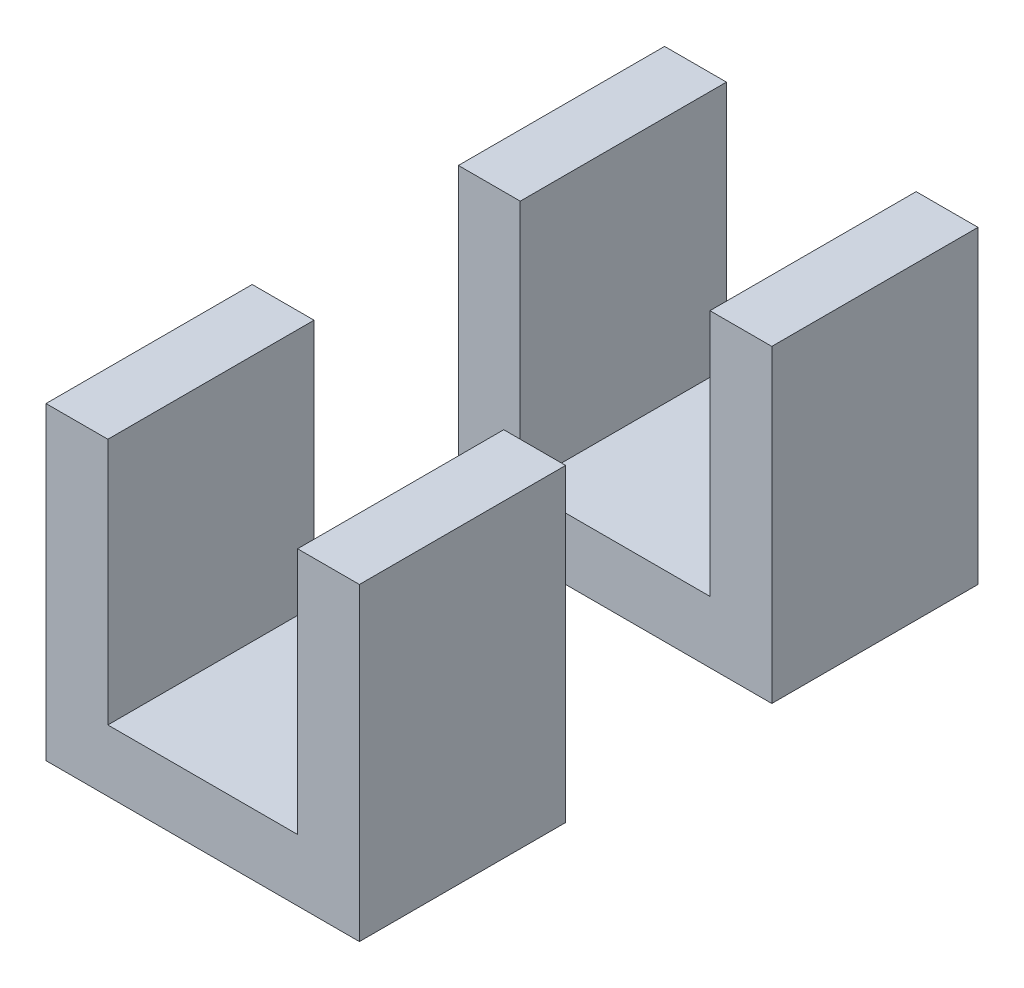
ISO-10303-21;
HEADER;
FILE_DESCRIPTION(('STEP AP214'),'2;1');
FILE_NAME('part.step','',(''),(''),'','','');
FILE_SCHEMA(('AUTOMOTIVE_DESIGN { 1 0 10303 214 1 1 1 1 }'));
ENDSEC;
DATA;
#1=APPLICATION_CONTEXT('core data for automotive mechanical design processes');
#2=APPLICATION_PROTOCOL_DEFINITION('international standard','automotive_design',2000,#1);
#3=PRODUCT_CONTEXT('',#1,'mechanical');
#4=PRODUCT('Part','Part','',(#3));
#5=PRODUCT_RELATED_PRODUCT_CATEGORY('part','',(#4));
#6=PRODUCT_DEFINITION_FORMATION('','',#4);
#7=PRODUCT_DEFINITION_CONTEXT('part definition',#1,'design');
#8=PRODUCT_DEFINITION('design','',#6,#7);
#9=PRODUCT_DEFINITION_SHAPE('','',#8);
#10=(LENGTH_UNIT() NAMED_UNIT(*) SI_UNIT(.MILLI.,.METRE.));
#11=(NAMED_UNIT(*) PLANE_ANGLE_UNIT() SI_UNIT($,.RADIAN.));
#12=(NAMED_UNIT(*) SI_UNIT($,.STERADIAN.) SOLID_ANGLE_UNIT());
#13=UNCERTAINTY_MEASURE_WITH_UNIT(LENGTH_MEASURE(1.E-05),#10,'distance_accuracy_value','');
#14=(GEOMETRIC_REPRESENTATION_CONTEXT(3) GLOBAL_UNCERTAINTY_ASSIGNED_CONTEXT((#13)) GLOBAL_UNIT_ASSIGNED_CONTEXT((#10,
#11,#12)) REPRESENTATION_CONTEXT('',''));
#15=CARTESIAN_POINT('',(0.,0.,0.));
#16=DIRECTION('',(0.,0.,1.));
#17=DIRECTION('',(1.,0.,0.));
#18=AXIS2_PLACEMENT_3D('',#15,#16,#17);
#19=CARTESIAN_POINT('',(-7.6,15.,30.));
#20=DIRECTION('',(0.,-1.,0.));
#21=DIRECTION('',(0.,0.,-1.));
#22=AXIS2_PLACEMENT_3D('',#19,#20,#21);
#23=PLANE('',#22);
#24=DIRECTION('',(-1.,0.,0.));
#25=VECTOR('',#24,1.);
#26=CARTESIAN_POINT('',(-7.6,15.,20.));
#27=LINE('',#26,#25);
#28=CARTESIAN_POINT('',(-4.6,15.,20.));
#29=VERTEX_POINT('',#28);
#30=CARTESIAN_POINT('',(-7.6,15.,20.));
#31=VERTEX_POINT('',#30);
#32=EDGE_CURVE('E139',#29,#31,#27,.T.);
#33=ORIENTED_EDGE('',*,*,#32,.T.);
#34=DIRECTION('',(0.,0.,-1.));
#35=VECTOR('',#34,1.);
#36=CARTESIAN_POINT('',(-7.6,15.,30.));
#37=LINE('',#36,#35);
#38=CARTESIAN_POINT('',(-7.6,15.,30.));
#39=VERTEX_POINT('',#38);
#40=EDGE_CURVE('E12',#39,#31,#37,.T.);
#41=ORIENTED_EDGE('',*,*,#40,.F.);
#42=DIRECTION('',(-1.,0.,0.));
#43=VECTOR('',#42,1.);
#44=CARTESIAN_POINT('',(-7.6,15.,30.));
#45=LINE('',#44,#43);
#46=CARTESIAN_POINT('',(-4.6,15.,30.));
#47=VERTEX_POINT('',#46);
#48=EDGE_CURVE('E153',#47,#39,#45,.T.);
#49=ORIENTED_EDGE('',*,*,#48,.F.);
#50=DIRECTION('',(0.,0.,-1.));
#51=VECTOR('',#50,1.);
#52=CARTESIAN_POINT('',(-4.6,15.,30.));
#53=LINE('',#52,#51);
#54=EDGE_CURVE('E135',#47,#29,#53,.T.);
#55=ORIENTED_EDGE('',*,*,#54,.T.);
#56=EDGE_LOOP('',(#33,#41,#49,#55));
#57=FACE_BOUND('',#56,.T.);
#58=ADVANCED_FACE('F43',(#57),#23,.F.);
#59=CARTESIAN_POINT('',(-7.6,0.,30.));
#60=DIRECTION('',(1.,0.,0.));
#61=DIRECTION('',(0.,1.,0.));
#62=AXIS2_PLACEMENT_3D('',#59,#60,#61);
#63=PLANE('',#62);
#64=DIRECTION('',(0.,-1.,0.));
#65=VECTOR('',#64,1.);
#66=CARTESIAN_POINT('',(-7.6,0.,20.));
#67=LINE('',#66,#65);
#68=CARTESIAN_POINT('',(-7.6,0.,20.));
#69=VERTEX_POINT('',#68);
#70=EDGE_CURVE('E142',#31,#69,#67,.T.);
#71=ORIENTED_EDGE('',*,*,#70,.T.);
#72=DIRECTION('',(0.,0.,-1.));
#73=VECTOR('',#72,1.);
#74=CARTESIAN_POINT('',(-7.6,0.,30.));
#75=LINE('',#74,#73);
#76=CARTESIAN_POINT('',(-7.6,0.,30.));
#77=VERTEX_POINT('',#76);
#78=EDGE_CURVE('E51',#77,#69,#75,.T.);
#79=ORIENTED_EDGE('',*,*,#78,.F.);
#80=DIRECTION('',(0.,-1.,0.));
#81=VECTOR('',#80,1.);
#82=CARTESIAN_POINT('',(-7.6,0.,30.));
#83=LINE('',#82,#81);
#84=EDGE_CURVE('E102',#39,#77,#83,.T.);
#85=ORIENTED_EDGE('',*,*,#84,.F.);
#86=ORIENTED_EDGE('',*,*,#40,.T.);
#87=EDGE_LOOP('',(#71,#79,#85,#86));
#88=FACE_BOUND('',#87,.T.);
#89=ADVANCED_FACE('F188',(#88),#63,.F.);
#90=CARTESIAN_POINT('',(7.6,0.,30.));
#91=DIRECTION('',(0.,1.,0.));
#92=DIRECTION('',(0.,0.,1.));
#93=AXIS2_PLACEMENT_3D('',#90,#91,#92);
#94=PLANE('',#93);
#95=DIRECTION('',(1.,0.,0.));
#96=VECTOR('',#95,1.);
#97=CARTESIAN_POINT('',(7.6,0.,20.));
#98=LINE('',#97,#96);
#99=CARTESIAN_POINT('',(7.6,0.,20.));
#100=VERTEX_POINT('',#99);
#101=EDGE_CURVE('E144',#69,#100,#98,.T.);
#102=ORIENTED_EDGE('',*,*,#101,.T.);
#103=DIRECTION('',(0.,0.,-1.));
#104=VECTOR('',#103,1.);
#105=CARTESIAN_POINT('',(7.6,0.,30.));
#106=LINE('',#105,#104);
#107=CARTESIAN_POINT('',(7.6,0.,30.));
#108=VERTEX_POINT('',#107);
#109=EDGE_CURVE('E160',#108,#100,#106,.T.);
#110=ORIENTED_EDGE('',*,*,#109,.F.);
#111=DIRECTION('',(1.,0.,0.));
#112=VECTOR('',#111,1.);
#113=CARTESIAN_POINT('',(7.6,0.,30.));
#114=LINE('',#113,#112);
#115=EDGE_CURVE('E168',#77,#108,#114,.T.);
#116=ORIENTED_EDGE('',*,*,#115,.F.);
#117=ORIENTED_EDGE('',*,*,#78,.T.);
#118=EDGE_LOOP('',(#102,#110,#116,#117));
#119=FACE_BOUND('',#118,.T.);
#120=ADVANCED_FACE('F166',(#119),#94,.F.);
#121=CARTESIAN_POINT('',(7.6,15.,30.));
#122=DIRECTION('',(-1.,0.,0.));
#123=DIRECTION('',(0.,-1.,0.));
#124=AXIS2_PLACEMENT_3D('',#121,#122,#123);
#125=PLANE('',#124);
#126=DIRECTION('',(0.,1.,0.));
#127=VECTOR('',#126,1.);
#128=CARTESIAN_POINT('',(7.6,15.,20.));
#129=LINE('',#128,#127);
#130=CARTESIAN_POINT('',(7.6,15.,20.));
#131=VERTEX_POINT('',#130);
#132=EDGE_CURVE('E146',#100,#131,#129,.T.);
#133=ORIENTED_EDGE('',*,*,#132,.T.);
#134=DIRECTION('',(0.,0.,-1.));
#135=VECTOR('',#134,1.);
#136=CARTESIAN_POINT('',(7.6,15.,30.));
#137=LINE('',#136,#135);
#138=CARTESIAN_POINT('',(7.6,15.,30.));
#139=VERTEX_POINT('',#138);
#140=EDGE_CURVE('E157',#139,#131,#137,.T.);
#141=ORIENTED_EDGE('',*,*,#140,.F.);
#142=DIRECTION('',(0.,1.,0.));
#143=VECTOR('',#142,1.);
#144=CARTESIAN_POINT('',(7.6,15.,30.));
#145=LINE('',#144,#143);
#146=EDGE_CURVE('E180',#108,#139,#145,.T.);
#147=ORIENTED_EDGE('',*,*,#146,.F.);
#148=ORIENTED_EDGE('',*,*,#109,.T.);
#149=EDGE_LOOP('',(#133,#141,#147,#148));
#150=FACE_BOUND('',#149,.T.);
#151=ADVANCED_FACE('F176',(#150),#125,.F.);
#152=CARTESIAN_POINT('',(4.6,15.,30.));
#153=DIRECTION('',(0.,-1.,0.));
#154=DIRECTION('',(0.,0.,-1.));
#155=AXIS2_PLACEMENT_3D('',#152,#153,#154);
#156=PLANE('',#155);
#157=DIRECTION('',(-1.,0.,0.));
#158=VECTOR('',#157,1.);
#159=CARTESIAN_POINT('',(4.6,15.,20.));
#160=LINE('',#159,#158);
#161=CARTESIAN_POINT('',(4.6,15.,20.));
#162=VERTEX_POINT('',#161);
#163=EDGE_CURVE('E148',#131,#162,#160,.T.);
#164=ORIENTED_EDGE('',*,*,#163,.T.);
#165=DIRECTION('',(0.,0.,-1.));
#166=VECTOR('',#165,1.);
#167=CARTESIAN_POINT('',(4.6,15.,30.));
#168=LINE('',#167,#166);
#169=CARTESIAN_POINT('',(4.6,15.,30.));
#170=VERTEX_POINT('',#169);
#171=EDGE_CURVE('E130',#170,#162,#168,.T.);
#172=ORIENTED_EDGE('',*,*,#171,.F.);
#173=DIRECTION('',(-1.,0.,0.));
#174=VECTOR('',#173,1.);
#175=CARTESIAN_POINT('',(4.6,15.,30.));
#176=LINE('',#175,#174);
#177=EDGE_CURVE('E121',#139,#170,#176,.T.);
#178=ORIENTED_EDGE('',*,*,#177,.F.);
#179=ORIENTED_EDGE('',*,*,#140,.T.);
#180=EDGE_LOOP('',(#164,#172,#178,#179));
#181=FACE_BOUND('',#180,.T.);
#182=ADVANCED_FACE('F179',(#181),#156,.F.);
#183=CARTESIAN_POINT('',(4.6,3.,30.));
#184=DIRECTION('',(1.,0.,0.));
#185=DIRECTION('',(0.,1.,0.));
#186=AXIS2_PLACEMENT_3D('',#183,#184,#185);
#187=PLANE('',#186);
#188=DIRECTION('',(0.,-1.,0.));
#189=VECTOR('',#188,1.);
#190=CARTESIAN_POINT('',(4.6,3.,20.));
#191=LINE('',#190,#189);
#192=CARTESIAN_POINT('',(4.6,3.,20.));
#193=VERTEX_POINT('',#192);
#194=EDGE_CURVE('E129',#162,#193,#191,.T.);
#195=ORIENTED_EDGE('',*,*,#194,.T.);
#196=DIRECTION('',(0.,0.,-1.));
#197=VECTOR('',#196,1.);
#198=CARTESIAN_POINT('',(4.6,3.,30.));
#199=LINE('',#198,#197);
#200=CARTESIAN_POINT('',(4.6,3.,30.));
#201=VERTEX_POINT('',#200);
#202=EDGE_CURVE('E126',#201,#193,#199,.T.);
#203=ORIENTED_EDGE('',*,*,#202,.F.);
#204=DIRECTION('',(0.,-1.,0.));
#205=VECTOR('',#204,1.);
#206=CARTESIAN_POINT('',(4.6,3.,30.));
#207=LINE('',#206,#205);
#208=EDGE_CURVE('E115',#170,#201,#207,.T.);
#209=ORIENTED_EDGE('',*,*,#208,.F.);
#210=ORIENTED_EDGE('',*,*,#171,.T.);
#211=EDGE_LOOP('',(#195,#203,#209,#210));
#212=FACE_BOUND('',#211,.T.);
#213=ADVANCED_FACE('F127',(#212),#187,.F.);
#214=CARTESIAN_POINT('',(-4.6,3.,30.));
#215=DIRECTION('',(0.,-1.,0.));
#216=DIRECTION('',(0.,0.,-1.));
#217=AXIS2_PLACEMENT_3D('',#214,#215,#216);
#218=PLANE('',#217);
#219=DIRECTION('',(-1.,0.,0.));
#220=VECTOR('',#219,1.);
#221=CARTESIAN_POINT('',(-4.6,3.,20.));
#222=LINE('',#221,#220);
#223=CARTESIAN_POINT('',(-4.6,3.,20.));
#224=VERTEX_POINT('',#223);
#225=EDGE_CURVE('E88',#193,#224,#222,.T.);
#226=ORIENTED_EDGE('',*,*,#225,.T.);
#227=DIRECTION('',(0.,0.,-1.));
#228=VECTOR('',#227,1.);
#229=CARTESIAN_POINT('',(-4.6,3.,30.));
#230=LINE('',#229,#228);
#231=CARTESIAN_POINT('',(-4.6,3.,30.));
#232=VERTEX_POINT('',#231);
#233=EDGE_CURVE('E131',#232,#224,#230,.T.);
#234=ORIENTED_EDGE('',*,*,#233,.F.);
#235=DIRECTION('',(-1.,0.,0.));
#236=VECTOR('',#235,1.);
#237=CARTESIAN_POINT('',(-4.6,3.,30.));
#238=LINE('',#237,#236);
#239=EDGE_CURVE('E119',#201,#232,#238,.T.);
#240=ORIENTED_EDGE('',*,*,#239,.F.);
#241=ORIENTED_EDGE('',*,*,#202,.T.);
#242=EDGE_LOOP('',(#226,#234,#240,#241));
#243=FACE_BOUND('',#242,.T.);
#244=ADVANCED_FACE('F133',(#243),#218,.F.);
#245=CARTESIAN_POINT('',(-4.6,15.,30.));
#246=DIRECTION('',(-1.,0.,0.));
#247=DIRECTION('',(0.,-1.,0.));
#248=AXIS2_PLACEMENT_3D('',#245,#246,#247);
#249=PLANE('',#248);
#250=DIRECTION('',(0.,1.,0.));
#251=VECTOR('',#250,1.);
#252=CARTESIAN_POINT('',(-4.6,15.,20.));
#253=LINE('',#252,#251);
#254=EDGE_CURVE('E94',#224,#29,#253,.T.);
#255=ORIENTED_EDGE('',*,*,#254,.T.);
#256=ORIENTED_EDGE('',*,*,#54,.F.);
#257=DIRECTION('',(0.,1.,0.));
#258=VECTOR('',#257,1.);
#259=CARTESIAN_POINT('',(-4.6,15.,30.));
#260=LINE('',#259,#258);
#261=EDGE_CURVE('E59',#232,#47,#260,.T.);
#262=ORIENTED_EDGE('',*,*,#261,.F.);
#263=ORIENTED_EDGE('',*,*,#233,.T.);
#264=EDGE_LOOP('',(#255,#256,#262,#263));
#265=FACE_BOUND('',#264,.T.);
#266=ADVANCED_FACE('F204',(#265),#249,.F.);
#267=CARTESIAN_POINT('',(0.,0.,30.));
#268=DIRECTION('',(0.,0.,-1.));
#269=DIRECTION('',(-1.,0.,0.));
#270=AXIS2_PLACEMENT_3D('',#267,#268,#269);
#271=PLANE('',#270);
#272=ORIENTED_EDGE('',*,*,#48,.T.);
#273=ORIENTED_EDGE('',*,*,#84,.T.);
#274=ORIENTED_EDGE('',*,*,#115,.T.);
#275=ORIENTED_EDGE('',*,*,#146,.T.);
#276=ORIENTED_EDGE('',*,*,#177,.T.);
#277=ORIENTED_EDGE('',*,*,#208,.T.);
#278=ORIENTED_EDGE('',*,*,#239,.T.);
#279=ORIENTED_EDGE('',*,*,#261,.T.);
#280=EDGE_LOOP('',(#272,#273,#274,#275,#276,#277,#278,#279));
#281=FACE_BOUND('',#280,.T.);
#282=ADVANCED_FACE('F117',(#281),#271,.F.);
#283=CARTESIAN_POINT('',(0.,0.,20.));
#284=DIRECTION('',(0.,0.,-1.));
#285=DIRECTION('',(-1.,0.,0.));
#286=AXIS2_PLACEMENT_3D('',#283,#284,#285);
#287=PLANE('',#286);
#288=ORIENTED_EDGE('',*,*,#32,.F.);
#289=ORIENTED_EDGE('',*,*,#254,.F.);
#290=ORIENTED_EDGE('',*,*,#225,.F.);
#291=ORIENTED_EDGE('',*,*,#194,.F.);
#292=ORIENTED_EDGE('',*,*,#163,.F.);
#293=ORIENTED_EDGE('',*,*,#132,.F.);
#294=ORIENTED_EDGE('',*,*,#101,.F.);
#295=ORIENTED_EDGE('',*,*,#70,.F.);
#296=EDGE_LOOP('',(#288,#289,#290,#291,#292,#293,#294,#295));
#297=FACE_BOUND('',#296,.T.);
#298=ADVANCED_FACE('F172',(#297),#287,.T.);
#299=CLOSED_SHELL('',(#58,#89,#120,#151,#182,#213,#244,#266,#282,#298));
#300=MANIFOLD_SOLID_BREP('B2',#299);
#301=CARTESIAN_POINT('',(-7.6,15.,10.));
#302=DIRECTION('',(0.,-1.,0.));
#303=DIRECTION('',(0.,0.,-1.));
#304=AXIS2_PLACEMENT_3D('',#301,#302,#303);
#305=PLANE('',#304);
#306=DIRECTION('',(-1.,0.,0.));
#307=VECTOR('',#306,1.);
#308=CARTESIAN_POINT('',(-7.6,15.,0.));
#309=LINE('',#308,#307);
#310=CARTESIAN_POINT('',(-4.6,15.,0.));
#311=VERTEX_POINT('',#310);
#312=CARTESIAN_POINT('',(-7.6,15.,0.));
#313=VERTEX_POINT('',#312);
#314=EDGE_CURVE('E367',#311,#313,#309,.T.);
#315=ORIENTED_EDGE('',*,*,#314,.T.);
#316=DIRECTION('',(0.,0.,-1.));
#317=VECTOR('',#316,1.);
#318=CARTESIAN_POINT('',(-7.6,15.,10.));
#319=LINE('',#318,#317);
#320=CARTESIAN_POINT('',(-7.6,15.,10.));
#321=VERTEX_POINT('',#320);
#322=EDGE_CURVE('E41',#321,#313,#319,.T.);
#323=ORIENTED_EDGE('',*,*,#322,.F.);
#324=DIRECTION('',(-1.,0.,0.));
#325=VECTOR('',#324,1.);
#326=CARTESIAN_POINT('',(-7.6,15.,10.));
#327=LINE('',#326,#325);
#328=CARTESIAN_POINT('',(-4.6,15.,10.));
#329=VERTEX_POINT('',#328);
#330=EDGE_CURVE('E381',#329,#321,#327,.T.);
#331=ORIENTED_EDGE('',*,*,#330,.F.);
#332=DIRECTION('',(0.,0.,-1.));
#333=VECTOR('',#332,1.);
#334=CARTESIAN_POINT('',(-4.6,15.,10.));
#335=LINE('',#334,#333);
#336=EDGE_CURVE('E363',#329,#311,#335,.T.);
#337=ORIENTED_EDGE('',*,*,#336,.T.);
#338=EDGE_LOOP('',(#315,#323,#331,#337));
#339=FACE_BOUND('',#338,.T.);
#340=ADVANCED_FACE('F271',(#339),#305,.F.);
#341=CARTESIAN_POINT('',(-7.6,0.,10.));
#342=DIRECTION('',(1.,0.,0.));
#343=DIRECTION('',(0.,1.,0.));
#344=AXIS2_PLACEMENT_3D('',#341,#342,#343);
#345=PLANE('',#344);
#346=DIRECTION('',(0.,-1.,0.));
#347=VECTOR('',#346,1.);
#348=CARTESIAN_POINT('',(-7.6,0.,0.));
#349=LINE('',#348,#347);
#350=CARTESIAN_POINT('',(-7.6,0.,0.));
#351=VERTEX_POINT('',#350);
#352=EDGE_CURVE('E370',#313,#351,#349,.T.);
#353=ORIENTED_EDGE('',*,*,#352,.T.);
#354=DIRECTION('',(0.,0.,-1.));
#355=VECTOR('',#354,1.);
#356=CARTESIAN_POINT('',(-7.6,0.,10.));
#357=LINE('',#356,#355);
#358=CARTESIAN_POINT('',(-7.6,0.,10.));
#359=VERTEX_POINT('',#358);
#360=EDGE_CURVE('E279',#359,#351,#357,.T.);
#361=ORIENTED_EDGE('',*,*,#360,.F.);
#362=DIRECTION('',(0.,-1.,0.));
#363=VECTOR('',#362,1.);
#364=CARTESIAN_POINT('',(-7.6,0.,10.));
#365=LINE('',#364,#363);
#366=EDGE_CURVE('E330',#321,#359,#365,.T.);
#367=ORIENTED_EDGE('',*,*,#366,.F.);
#368=ORIENTED_EDGE('',*,*,#322,.T.);
#369=EDGE_LOOP('',(#353,#361,#367,#368));
#370=FACE_BOUND('',#369,.T.);
#371=ADVANCED_FACE('F416',(#370),#345,.F.);
#372=CARTESIAN_POINT('',(7.6,0.,10.));
#373=DIRECTION('',(0.,1.,0.));
#374=DIRECTION('',(0.,0.,1.));
#375=AXIS2_PLACEMENT_3D('',#372,#373,#374);
#376=PLANE('',#375);
#377=DIRECTION('',(1.,0.,0.));
#378=VECTOR('',#377,1.);
#379=CARTESIAN_POINT('',(7.6,0.,0.));
#380=LINE('',#379,#378);
#381=CARTESIAN_POINT('',(7.6,0.,0.));
#382=VERTEX_POINT('',#381);
#383=EDGE_CURVE('E372',#351,#382,#380,.T.);
#384=ORIENTED_EDGE('',*,*,#383,.T.);
#385=DIRECTION('',(0.,0.,-1.));
#386=VECTOR('',#385,1.);
#387=CARTESIAN_POINT('',(7.6,0.,10.));
#388=LINE('',#387,#386);
#389=CARTESIAN_POINT('',(7.6,0.,10.));
#390=VERTEX_POINT('',#389);
#391=EDGE_CURVE('E388',#390,#382,#388,.T.);
#392=ORIENTED_EDGE('',*,*,#391,.F.);
#393=DIRECTION('',(1.,0.,0.));
#394=VECTOR('',#393,1.);
#395=CARTESIAN_POINT('',(7.6,0.,10.));
#396=LINE('',#395,#394);
#397=EDGE_CURVE('E396',#359,#390,#396,.T.);
#398=ORIENTED_EDGE('',*,*,#397,.F.);
#399=ORIENTED_EDGE('',*,*,#360,.T.);
#400=EDGE_LOOP('',(#384,#392,#398,#399));
#401=FACE_BOUND('',#400,.T.);
#402=ADVANCED_FACE('F394',(#401),#376,.F.);
#403=CARTESIAN_POINT('',(7.6,15.,10.));
#404=DIRECTION('',(-1.,0.,0.));
#405=DIRECTION('',(0.,-1.,0.));
#406=AXIS2_PLACEMENT_3D('',#403,#404,#405);
#407=PLANE('',#406);
#408=DIRECTION('',(0.,1.,0.));
#409=VECTOR('',#408,1.);
#410=CARTESIAN_POINT('',(7.6,15.,0.));
#411=LINE('',#410,#409);
#412=CARTESIAN_POINT('',(7.6,15.,0.));
#413=VERTEX_POINT('',#412);
#414=EDGE_CURVE('E374',#382,#413,#411,.T.);
#415=ORIENTED_EDGE('',*,*,#414,.T.);
#416=DIRECTION('',(0.,0.,-1.));
#417=VECTOR('',#416,1.);
#418=CARTESIAN_POINT('',(7.6,15.,10.));
#419=LINE('',#418,#417);
#420=CARTESIAN_POINT('',(7.6,15.,10.));
#421=VERTEX_POINT('',#420);
#422=EDGE_CURVE('E385',#421,#413,#419,.T.);
#423=ORIENTED_EDGE('',*,*,#422,.F.);
#424=DIRECTION('',(0.,1.,0.));
#425=VECTOR('',#424,1.);
#426=CARTESIAN_POINT('',(7.6,15.,10.));
#427=LINE('',#426,#425);
#428=EDGE_CURVE('E408',#390,#421,#427,.T.);
#429=ORIENTED_EDGE('',*,*,#428,.F.);
#430=ORIENTED_EDGE('',*,*,#391,.T.);
#431=EDGE_LOOP('',(#415,#423,#429,#430));
#432=FACE_BOUND('',#431,.T.);
#433=ADVANCED_FACE('F404',(#432),#407,.F.);
#434=CARTESIAN_POINT('',(4.6,15.,10.));
#435=DIRECTION('',(0.,-1.,0.));
#436=DIRECTION('',(0.,0.,-1.));
#437=AXIS2_PLACEMENT_3D('',#434,#435,#436);
#438=PLANE('',#437);
#439=DIRECTION('',(-1.,0.,0.));
#440=VECTOR('',#439,1.);
#441=CARTESIAN_POINT('',(4.6,15.,0.));
#442=LINE('',#441,#440);
#443=CARTESIAN_POINT('',(4.6,15.,0.));
#444=VERTEX_POINT('',#443);
#445=EDGE_CURVE('E376',#413,#444,#442,.T.);
#446=ORIENTED_EDGE('',*,*,#445,.T.);
#447=DIRECTION('',(0.,0.,-1.));
#448=VECTOR('',#447,1.);
#449=CARTESIAN_POINT('',(4.6,15.,10.));
#450=LINE('',#449,#448);
#451=CARTESIAN_POINT('',(4.6,15.,10.));
#452=VERTEX_POINT('',#451);
#453=EDGE_CURVE('E358',#452,#444,#450,.T.);
#454=ORIENTED_EDGE('',*,*,#453,.F.);
#455=DIRECTION('',(-1.,0.,0.));
#456=VECTOR('',#455,1.);
#457=CARTESIAN_POINT('',(4.6,15.,10.));
#458=LINE('',#457,#456);
#459=EDGE_CURVE('E349',#421,#452,#458,.T.);
#460=ORIENTED_EDGE('',*,*,#459,.F.);
#461=ORIENTED_EDGE('',*,*,#422,.T.);
#462=EDGE_LOOP('',(#446,#454,#460,#461));
#463=FACE_BOUND('',#462,.T.);
#464=ADVANCED_FACE('F407',(#463),#438,.F.);
#465=CARTESIAN_POINT('',(4.6,3.,10.));
#466=DIRECTION('',(1.,0.,0.));
#467=DIRECTION('',(0.,1.,0.));
#468=AXIS2_PLACEMENT_3D('',#465,#466,#467);
#469=PLANE('',#468);
#470=DIRECTION('',(0.,-1.,0.));
#471=VECTOR('',#470,1.);
#472=CARTESIAN_POINT('',(4.6,3.,0.));
#473=LINE('',#472,#471);
#474=CARTESIAN_POINT('',(4.6,3.,0.));
#475=VERTEX_POINT('',#474);
#476=EDGE_CURVE('E357',#444,#475,#473,.T.);
#477=ORIENTED_EDGE('',*,*,#476,.T.);
#478=DIRECTION('',(0.,0.,-1.));
#479=VECTOR('',#478,1.);
#480=CARTESIAN_POINT('',(4.6,3.,10.));
#481=LINE('',#480,#479);
#482=CARTESIAN_POINT('',(4.6,3.,10.));
#483=VERTEX_POINT('',#482);
#484=EDGE_CURVE('E354',#483,#475,#481,.T.);
#485=ORIENTED_EDGE('',*,*,#484,.F.);
#486=DIRECTION('',(0.,-1.,0.));
#487=VECTOR('',#486,1.);
#488=CARTESIAN_POINT('',(4.6,3.,10.));
#489=LINE('',#488,#487);
#490=EDGE_CURVE('E343',#452,#483,#489,.T.);
#491=ORIENTED_EDGE('',*,*,#490,.F.);
#492=ORIENTED_EDGE('',*,*,#453,.T.);
#493=EDGE_LOOP('',(#477,#485,#491,#492));
#494=FACE_BOUND('',#493,.T.);
#495=ADVANCED_FACE('F355',(#494),#469,.F.);
#496=CARTESIAN_POINT('',(-4.6,3.,10.));
#497=DIRECTION('',(0.,-1.,0.));
#498=DIRECTION('',(0.,0.,-1.));
#499=AXIS2_PLACEMENT_3D('',#496,#497,#498);
#500=PLANE('',#499);
#501=DIRECTION('',(-1.,0.,0.));
#502=VECTOR('',#501,1.);
#503=CARTESIAN_POINT('',(-4.6,3.,0.));
#504=LINE('',#503,#502);
#505=CARTESIAN_POINT('',(-4.6,3.,0.));
#506=VERTEX_POINT('',#505);
#507=EDGE_CURVE('E316',#475,#506,#504,.T.);
#508=ORIENTED_EDGE('',*,*,#507,.T.);
#509=DIRECTION('',(0.,0.,-1.));
#510=VECTOR('',#509,1.);
#511=CARTESIAN_POINT('',(-4.6,3.,10.));
#512=LINE('',#511,#510);
#513=CARTESIAN_POINT('',(-4.6,3.,10.));
#514=VERTEX_POINT('',#513);
#515=EDGE_CURVE('E359',#514,#506,#512,.T.);
#516=ORIENTED_EDGE('',*,*,#515,.F.);
#517=DIRECTION('',(-1.,0.,0.));
#518=VECTOR('',#517,1.);
#519=CARTESIAN_POINT('',(-4.6,3.,10.));
#520=LINE('',#519,#518);
#521=EDGE_CURVE('E347',#483,#514,#520,.T.);
#522=ORIENTED_EDGE('',*,*,#521,.F.);
#523=ORIENTED_EDGE('',*,*,#484,.T.);
#524=EDGE_LOOP('',(#508,#516,#522,#523));
#525=FACE_BOUND('',#524,.T.);
#526=ADVANCED_FACE('F361',(#525),#500,.F.);
#527=CARTESIAN_POINT('',(-4.6,15.,10.));
#528=DIRECTION('',(-1.,0.,0.));
#529=DIRECTION('',(0.,-1.,0.));
#530=AXIS2_PLACEMENT_3D('',#527,#528,#529);
#531=PLANE('',#530);
#532=DIRECTION('',(0.,1.,0.));
#533=VECTOR('',#532,1.);
#534=CARTESIAN_POINT('',(-4.6,15.,0.));
#535=LINE('',#534,#533);
#536=EDGE_CURVE('E322',#506,#311,#535,.T.);
#537=ORIENTED_EDGE('',*,*,#536,.T.);
#538=ORIENTED_EDGE('',*,*,#336,.F.);
#539=DIRECTION('',(0.,1.,0.));
#540=VECTOR('',#539,1.);
#541=CARTESIAN_POINT('',(-4.6,15.,10.));
#542=LINE('',#541,#540);
#543=EDGE_CURVE('E287',#514,#329,#542,.T.);
#544=ORIENTED_EDGE('',*,*,#543,.F.);
#545=ORIENTED_EDGE('',*,*,#515,.T.);
#546=EDGE_LOOP('',(#537,#538,#544,#545));
#547=FACE_BOUND('',#546,.T.);
#548=ADVANCED_FACE('F432',(#547),#531,.F.);
#549=CARTESIAN_POINT('',(0.,0.,10.));
#550=DIRECTION('',(0.,0.,-1.));
#551=DIRECTION('',(-1.,0.,0.));
#552=AXIS2_PLACEMENT_3D('',#549,#550,#551);
#553=PLANE('',#552);
#554=ORIENTED_EDGE('',*,*,#330,.T.);
#555=ORIENTED_EDGE('',*,*,#366,.T.);
#556=ORIENTED_EDGE('',*,*,#397,.T.);
#557=ORIENTED_EDGE('',*,*,#428,.T.);
#558=ORIENTED_EDGE('',*,*,#459,.T.);
#559=ORIENTED_EDGE('',*,*,#490,.T.);
#560=ORIENTED_EDGE('',*,*,#521,.T.);
#561=ORIENTED_EDGE('',*,*,#543,.T.);
#562=EDGE_LOOP('',(#554,#555,#556,#557,#558,#559,#560,#561));
#563=FACE_BOUND('',#562,.T.);
#564=ADVANCED_FACE('F345',(#563),#553,.F.);
#565=CARTESIAN_POINT('',(0.,0.,0.));
#566=DIRECTION('',(0.,0.,-1.));
#567=DIRECTION('',(-1.,0.,0.));
#568=AXIS2_PLACEMENT_3D('',#565,#566,#567);
#569=PLANE('',#568);
#570=ORIENTED_EDGE('',*,*,#314,.F.);
#571=ORIENTED_EDGE('',*,*,#536,.F.);
#572=ORIENTED_EDGE('',*,*,#507,.F.);
#573=ORIENTED_EDGE('',*,*,#476,.F.);
#574=ORIENTED_EDGE('',*,*,#445,.F.);
#575=ORIENTED_EDGE('',*,*,#414,.F.);
#576=ORIENTED_EDGE('',*,*,#383,.F.);
#577=ORIENTED_EDGE('',*,*,#352,.F.);
#578=EDGE_LOOP('',(#570,#571,#572,#573,#574,#575,#576,#577));
#579=FACE_BOUND('',#578,.T.);
#580=ADVANCED_FACE('F400',(#579),#569,.T.);
#581=CLOSED_SHELL('',(#340,#371,#402,#433,#464,#495,#526,#548,#564,#580));
#582=MANIFOLD_SOLID_BREP('B6',#581);
#583=ADVANCED_BREP_SHAPE_REPRESENTATION('',(#18,#300,#582),#14);
#584=SHAPE_DEFINITION_REPRESENTATION(#9,#583);
ENDSEC;
END-ISO-10303-21;
